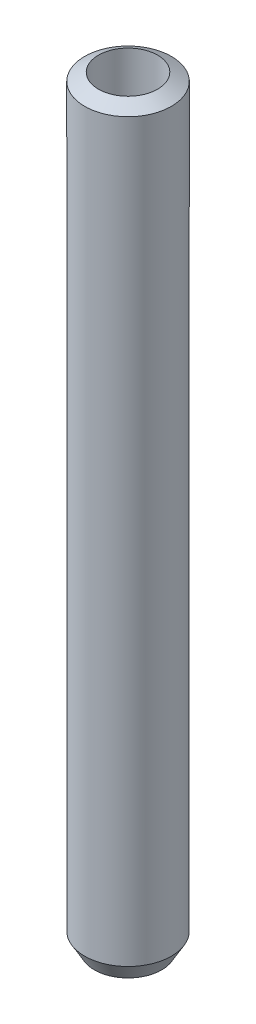
ISO-10303-21;
HEADER;
FILE_DESCRIPTION(('STEP AP214'),'2;1');
FILE_NAME('part.step','',(''),(''),'','','');
FILE_SCHEMA(('AUTOMOTIVE_DESIGN { 1 0 10303 214 1 1 1 1 }'));
ENDSEC;
DATA;
#1=APPLICATION_CONTEXT('core data for automotive mechanical design processes');
#2=APPLICATION_PROTOCOL_DEFINITION('international standard','automotive_design',2000,#1);
#3=PRODUCT_CONTEXT('',#1,'mechanical');
#4=PRODUCT('Part','Part','',(#3));
#5=PRODUCT_RELATED_PRODUCT_CATEGORY('part','',(#4));
#6=PRODUCT_DEFINITION_FORMATION('','',#4);
#7=PRODUCT_DEFINITION_CONTEXT('part definition',#1,'design');
#8=PRODUCT_DEFINITION('design','',#6,#7);
#9=PRODUCT_DEFINITION_SHAPE('','',#8);
#10=(LENGTH_UNIT() NAMED_UNIT(*) SI_UNIT(.MILLI.,.METRE.));
#11=(NAMED_UNIT(*) PLANE_ANGLE_UNIT() SI_UNIT($,.RADIAN.));
#12=(NAMED_UNIT(*) SI_UNIT($,.STERADIAN.) SOLID_ANGLE_UNIT());
#13=UNCERTAINTY_MEASURE_WITH_UNIT(LENGTH_MEASURE(1.E-05),#10,'distance_accuracy_value','');
#14=(GEOMETRIC_REPRESENTATION_CONTEXT(3) GLOBAL_UNCERTAINTY_ASSIGNED_CONTEXT((#13)) GLOBAL_UNIT_ASSIGNED_CONTEXT((#10,
#11,#12)) REPRESENTATION_CONTEXT('',''));
#15=CARTESIAN_POINT('',(0.,0.,0.));
#16=DIRECTION('',(0.,0.,1.));
#17=DIRECTION('',(1.,0.,0.));
#18=AXIS2_PLACEMENT_3D('',#15,#16,#17);
#19=CARTESIAN_POINT('',(0.,395.812140232538,0.));
#20=DIRECTION('',(0.,-1.,0.));
#21=DIRECTION('',(0.,0.,-1.));
#22=AXIS2_PLACEMENT_3D('',#19,#20,#21);
#23=CYLINDRICAL_SURFACE('',#22,22.5);
#24=CARTESIAN_POINT('',(0.,390.783143770465,0.));
#25=DIRECTION('',(0.,1.,0.));
#26=DIRECTION('',(0.,0.,1.));
#27=AXIS2_PLACEMENT_3D('',#24,#25,#26);
#28=CIRCLE('',#27,22.5);
#29=CARTESIAN_POINT('',(0.,390.783143770465,-22.5));
#30=VERTEX_POINT('',#29);
#31=EDGE_CURVE('E50',#30,#30,#28,.F.);
#32=CARTESIAN_POINT('',(0.,8.71047738339487,0.));
#33=DIRECTION('',(0.,1.,0.));
#34=DIRECTION('',(0.,0.,1.));
#35=AXIS2_PLACEMENT_3D('',#32,#33,#34);
#36=CIRCLE('',#35,22.5);
#37=CARTESIAN_POINT('',(0.,8.71047738339481,-22.5));
#38=VERTEX_POINT('',#37);
#39=EDGE_CURVE('E51',#38,#38,#36,.T.);
#40=CARTESIAN_POINT('',(0.,390.783143770465,-22.5));
#41=CARTESIAN_POINT('',(0.,386.803220162266,-22.5));
#42=CARTESIAN_POINT('',(0.,382.823296554067,-22.5));
#43=CARTESIAN_POINT('',(0.,374.86344933767,-22.5));
#44=CARTESIAN_POINT('',(0.,370.883525729471,-22.5));
#45=CARTESIAN_POINT('',(0.,362.923678513074,-22.5));
#46=CARTESIAN_POINT('',(0.,358.943754904875,-22.5));
#47=CARTESIAN_POINT('',(0.,350.983907688478,-22.5));
#48=CARTESIAN_POINT('',(0.,347.00398408028,-22.5));
#49=CARTESIAN_POINT('',(0.,339.044136863882,-22.5));
#50=CARTESIAN_POINT('',(0.,335.064213255684,-22.5));
#51=CARTESIAN_POINT('',(0.,327.104366039286,-22.5));
#52=CARTESIAN_POINT('',(0.,323.124442431088,-22.5));
#53=CARTESIAN_POINT('',(0.,315.16459521469,-22.5));
#54=CARTESIAN_POINT('',(0.,311.184671606492,-22.5));
#55=CARTESIAN_POINT('',(0.,303.224824390094,-22.5));
#56=CARTESIAN_POINT('',(0.,299.244900781896,-22.5));
#57=CARTESIAN_POINT('',(0.,291.285053565499,-22.5));
#58=CARTESIAN_POINT('',(0.,287.3051299573,-22.5));
#59=CARTESIAN_POINT('',(0.,279.345282740903,-22.5));
#60=CARTESIAN_POINT('',(0.,275.365359132704,-22.5));
#61=CARTESIAN_POINT('',(0.,267.405511916307,-22.5));
#62=CARTESIAN_POINT('',(0.,263.425588308108,-22.5));
#63=CARTESIAN_POINT('',(0.,255.465741091711,-22.5));
#64=CARTESIAN_POINT('',(0.,251.485817483512,-22.5));
#65=CARTESIAN_POINT('',(0.,243.525970267115,-22.5));
#66=CARTESIAN_POINT('',(0.,239.546046658916,-22.5));
#67=CARTESIAN_POINT('',(0.,231.586199442519,-22.5));
#68=CARTESIAN_POINT('',(0.,227.60627583432,-22.5));
#69=CARTESIAN_POINT('',(0.,219.646428617923,-22.5));
#70=CARTESIAN_POINT('',(0.,215.666505009724,-22.5));
#71=CARTESIAN_POINT('',(0.,207.706657793327,-22.5));
#72=CARTESIAN_POINT('',(0.,203.726734185128,-22.5));
#73=CARTESIAN_POINT('',(0.,195.766886968731,-22.5));
#74=CARTESIAN_POINT('',(0.,191.786963360532,-22.5));
#75=CARTESIAN_POINT('',(0.,183.827116144135,-22.5));
#76=CARTESIAN_POINT('',(0.,179.847192535937,-22.5));
#77=CARTESIAN_POINT('',(0.,171.887345319539,-22.5));
#78=CARTESIAN_POINT('',(0.,167.907421711341,-22.5));
#79=CARTESIAN_POINT('',(0.,159.947574494943,-22.5));
#80=CARTESIAN_POINT('',(0.,155.967650886745,-22.5));
#81=CARTESIAN_POINT('',(0.,148.007803670347,-22.5));
#82=CARTESIAN_POINT('',(0.,144.027880062149,-22.5));
#83=CARTESIAN_POINT('',(0.,136.068032845751,-22.5));
#84=CARTESIAN_POINT('',(0.,132.088109237553,-22.5));
#85=CARTESIAN_POINT('',(0.,124.128262021155,-22.5));
#86=CARTESIAN_POINT('',(0.,120.148338412957,-22.5));
#87=CARTESIAN_POINT('',(0.,112.18849119656,-22.5));
#88=CARTESIAN_POINT('',(0.,108.208567588361,-22.5));
#89=CARTESIAN_POINT('',(0.,100.248720371964,-22.5));
#90=CARTESIAN_POINT('',(0.,96.268796763765,-22.5));
#91=CARTESIAN_POINT('',(0.,88.3089495473677,-22.5));
#92=CARTESIAN_POINT('',(0.,84.3290259391691,-22.5));
#93=CARTESIAN_POINT('',(0.,76.3691787227718,-22.5));
#94=CARTESIAN_POINT('',(0.,72.3892551145731,-22.5));
#95=CARTESIAN_POINT('',(0.,64.4294078981758,-22.5));
#96=CARTESIAN_POINT('',(0.,60.4494842899772,-22.5));
#97=CARTESIAN_POINT('',(0.,52.4896370735799,-22.5));
#98=CARTESIAN_POINT('',(0.,48.5097134653812,-22.5));
#99=CARTESIAN_POINT('',(0.,40.549866248984,-22.5));
#100=CARTESIAN_POINT('',(0.,36.5699426407853,-22.5));
#101=CARTESIAN_POINT('',(0.,28.610095424388,-22.5));
#102=CARTESIAN_POINT('',(0.,24.6301718161894,-22.5));
#103=CARTESIAN_POINT('',(0.,16.6703245997921,-22.5));
#104=CARTESIAN_POINT('',(0.,12.6904009915934,-22.5));
#105=CARTESIAN_POINT('',(0.,8.71047738339481,-22.5));
#106=B_SPLINE_CURVE_WITH_KNOTS('',3,(#40,#41,#42,#43,#44,#45,#46,#47,#48,#49,#50,#51,#52,#53,
#54,#55,#56,#57,#58,#59,#60,#61,#62,#63,#64,#65,#66,#67,#68,#69,#70,#71,#72,#73,#74,#75,#76,#77,
#78,#79,#80,#81,#82,#83,#84,#85,#86,#87,#88,#89,#90,#91,#92,#93,#94,#95,#96,#97,#98,#99,#100,
#101,#102,#103,#104,#105),.UNSPECIFIED.,.F.,.F.,(4,2,2,2,2,2,2,2,2,2,2,2,2,2,2,2,2,2,2,2,2,2,2,
2,2,2,2,2,2,2,2,2,4),(0.,11.9397708245959,23.8795416491918,35.8193124737878,47.7590832983837,
59.6988541229796,71.6386249475756,83.5783957721715,95.5181665967674,107.457937421363,
119.397708245959,131.337479070555,143.277249895151,155.217020719747,167.156791544343,
179.096562368939,191.036333193535,202.976104018131,214.915874842727,226.855645667323,
238.795416491919,250.735187316514,262.67495814111,274.614728965706,286.554499790302,
298.494270614898,310.434041439494,322.37381226409,334.313583088686,346.253353913282,
358.193124737878,370.132895562474,382.07266638707),.UNSPECIFIED.);
#107=EDGE_CURVE('BSEAM39',#30,#38,#106,.T.);
#108=ORIENTED_EDGE('',*,*,#31,.T.);
#109=ORIENTED_EDGE('',*,*,#39,.T.);
#110=ORIENTED_EDGE('',*,*,#107,.T.);
#111=ORIENTED_EDGE('',*,*,#107,.F.);
#112=EDGE_LOOP('',(#108,#110,#109,#111));
#113=FACE_BOUND('',#112,.T.);
#114=ADVANCED_FACE('F39',(#113),#23,.T.);
#115=CARTESIAN_POINT('',(0.,0.,0.));
#116=DIRECTION('',(0.,1.,0.));
#117=DIRECTION('',(0.,0.,1.));
#118=AXIS2_PLACEMENT_3D('',#115,#116,#117);
#119=PLANE('',#118);
#120=CARTESIAN_POINT('',(0.,0.,0.));
#121=DIRECTION('',(0.,1.,0.));
#122=DIRECTION('',(0.,0.,1.));
#123=AXIS2_PLACEMENT_3D('',#120,#121,#122);
#124=CIRCLE('',#123,17.4710035379268);
#125=CARTESIAN_POINT('',(0.,0.,17.4710035379268));
#126=VERTEX_POINT('',#125);
#127=EDGE_CURVE('E10',#126,#126,#124,.F.);
#128=ORIENTED_EDGE('',*,*,#127,.T.);
#129=EDGE_LOOP('',(#128));
#130=FACE_BOUND('',#129,.T.);
#131=CARTESIAN_POINT('',(0.,0.,0.));
#132=DIRECTION('',(0.,1.,0.));
#133=DIRECTION('',(0.,0.,1.));
#134=AXIS2_PLACEMENT_3D('',#131,#132,#133);
#135=CIRCLE('',#134,15.3464474844127);
#136=CARTESIAN_POINT('',(0.,0.,-15.3464474844127));
#137=VERTEX_POINT('',#136);
#138=EDGE_CURVE('E58',#137,#137,#135,.T.);
#139=ORIENTED_EDGE('',*,*,#138,.T.);
#140=EDGE_LOOP('',(#139));
#141=FACE_BOUND('',#140,.T.);
#142=ADVANCED_FACE('F62',(#130,#141),#119,.F.);
#143=CARTESIAN_POINT('',(0.,395.812140232538,0.));
#144=DIRECTION('',(0.,-1.,0.));
#145=DIRECTION('',(0.,0.,-1.));
#146=AXIS2_PLACEMENT_3D('',#143,#144,#145);
#147=CYLINDRICAL_SURFACE('',#146,15.3464474844127);
#148=CARTESIAN_POINT('',(0.,394.913249241001,0.));
#149=DIRECTION('',(0.,-1.,0.));
#150=DIRECTION('',(0.,0.,-1.));
#151=AXIS2_PLACEMENT_3D('',#148,#149,#150);
#152=CIRCLE('',#151,15.3464474844127);
#153=CARTESIAN_POINT('',(0.,394.913249241001,-15.3464474844127));
#154=VERTEX_POINT('',#153);
#155=EDGE_CURVE('E54',#154,#154,#152,.F.);
#156=CARTESIAN_POINT('',(0.,394.913249241001,-15.3464474844127));
#157=CARTESIAN_POINT('',(0.,390.799569561407,-15.3464474844127));
#158=CARTESIAN_POINT('',(0.,386.685889881814,-15.3464474844127));
#159=CARTESIAN_POINT('',(0.,378.458530522626,-15.3464474844127));
#160=CARTESIAN_POINT('',(0.,374.344850843032,-15.3464474844127));
#161=CARTESIAN_POINT('',(0.,366.117491483845,-15.3464474844127));
#162=CARTESIAN_POINT('',(0.,362.003811804251,-15.3464474844127));
#163=CARTESIAN_POINT('',(0.,353.776452445064,-15.3464474844127));
#164=CARTESIAN_POINT('',(0.,349.66277276547,-15.3464474844127));
#165=CARTESIAN_POINT('',(0.,341.435413406282,-15.3464474844127));
#166=CARTESIAN_POINT('',(0.,337.321733726688,-15.3464474844127));
#167=CARTESIAN_POINT('',(0.,329.094374367501,-15.3464474844127));
#168=CARTESIAN_POINT('',(0.,324.980694687907,-15.3464474844127));
#169=CARTESIAN_POINT('',(0.,316.75333532872,-15.3464474844127));
#170=CARTESIAN_POINT('',(0.,312.639655649126,-15.3464474844127));
#171=CARTESIAN_POINT('',(0.,304.412296289938,-15.3464474844127));
#172=CARTESIAN_POINT('',(0.,300.298616610345,-15.3464474844127));
#173=CARTESIAN_POINT('',(0.,292.071257251157,-15.3464474844127));
#174=CARTESIAN_POINT('',(0.,287.957577571563,-15.3464474844127));
#175=CARTESIAN_POINT('',(0.,279.730218212376,-15.3464474844127));
#176=CARTESIAN_POINT('',(0.,275.616538532782,-15.3464474844127));
#177=CARTESIAN_POINT('',(0.,267.389179173595,-15.3464474844127));
#178=CARTESIAN_POINT('',(0.,263.275499494001,-15.3464474844127));
#179=CARTESIAN_POINT('',(0.,255.048140134813,-15.3464474844127));
#180=CARTESIAN_POINT('',(0.,250.934460455219,-15.3464474844127));
#181=CARTESIAN_POINT('',(0.,242.707101096032,-15.3464474844127));
#182=CARTESIAN_POINT('',(0.,238.593421416438,-15.3464474844127));
#183=CARTESIAN_POINT('',(0.,230.366062057251,-15.3464474844127));
#184=CARTESIAN_POINT('',(0.,226.252382377657,-15.3464474844127));
#185=CARTESIAN_POINT('',(0.,218.025023018469,-15.3464474844127));
#186=CARTESIAN_POINT('',(0.,213.911343338876,-15.3464474844127));
#187=CARTESIAN_POINT('',(0.,205.683983979688,-15.3464474844127));
#188=CARTESIAN_POINT('',(0.,201.570304300094,-15.3464474844127));
#189=CARTESIAN_POINT('',(0.,193.342944940907,-15.3464474844127));
#190=CARTESIAN_POINT('',(0.,189.229265261313,-15.3464474844127));
#191=CARTESIAN_POINT('',(0.,181.001905902126,-15.3464474844127));
#192=CARTESIAN_POINT('',(0.,176.888226222532,-15.3464474844127));
#193=CARTESIAN_POINT('',(0.,168.660866863344,-15.3464474844127));
#194=CARTESIAN_POINT('',(0.,164.54718718375,-15.3464474844127));
#195=CARTESIAN_POINT('',(0.,156.319827824563,-15.3464474844127));
#196=CARTESIAN_POINT('',(0.,152.206148144969,-15.3464474844127));
#197=CARTESIAN_POINT('',(0.,143.978788785782,-15.3464474844127));
#198=CARTESIAN_POINT('',(0.,139.865109106188,-15.3464474844127));
#199=CARTESIAN_POINT('',(0.,131.637749747,-15.3464474844127));
#200=CARTESIAN_POINT('',(0.,127.524070067407,-15.3464474844127));
#201=CARTESIAN_POINT('',(0.,119.296710708219,-15.3464474844127));
#202=CARTESIAN_POINT('',(0.,115.183031028625,-15.3464474844127));
#203=CARTESIAN_POINT('',(0.,106.955671669438,-15.3464474844127));
#204=CARTESIAN_POINT('',(0.,102.841991989844,-15.3464474844127));
#205=CARTESIAN_POINT('',(0.,94.6146326306565,-15.3464474844127));
#206=CARTESIAN_POINT('',(0.,90.5009529510628,-15.3464474844127));
#207=CARTESIAN_POINT('',(0.,82.2735935918753,-15.3464474844127));
#208=CARTESIAN_POINT('',(0.,78.1599139122815,-15.3464474844127));
#209=CARTESIAN_POINT('',(0.,69.932554553094,-15.3464474844127));
#210=CARTESIAN_POINT('',(0.,65.8188748735002,-15.3464474844127));
#211=CARTESIAN_POINT('',(0.,57.5915155143126,-15.3464474844127));
#212=CARTESIAN_POINT('',(0.,53.4778358347189,-15.3464474844127));
#213=CARTESIAN_POINT('',(0.,45.2504764755314,-15.3464474844127));
#214=CARTESIAN_POINT('',(0.,41.1367967959376,-15.3464474844127));
#215=CARTESIAN_POINT('',(0.,32.9094374367501,-15.3464474844127));
#216=CARTESIAN_POINT('',(0.,28.7957577571563,-15.3464474844127));
#217=CARTESIAN_POINT('',(0.,20.5683983979688,-15.3464474844127));
#218=CARTESIAN_POINT('',(0.,16.454718718375,-15.3464474844127));
#219=CARTESIAN_POINT('',(0.,8.2273593591875,-15.3464474844127));
#220=CARTESIAN_POINT('',(0.,4.11367967959375,-15.3464474844127));
#221=CARTESIAN_POINT('',(0.,0.,-15.3464474844127));
#222=B_SPLINE_CURVE_WITH_KNOTS('',3,(#156,#157,#158,#159,#160,#161,#162,#163,#164,#165,#166,
#167,#168,#169,#170,#171,#172,#173,#174,#175,#176,#177,#178,#179,#180,#181,#182,#183,#184,#185,
#186,#187,#188,#189,#190,#191,#192,#193,#194,#195,#196,#197,#198,#199,#200,#201,#202,#203,#204,
#205,#206,#207,#208,#209,#210,#211,#212,#213,#214,#215,#216,#217,#218,#219,#220,#221),
.UNSPECIFIED.,.F.,.F.,(4,2,2,2,2,2,2,2,2,2,2,2,2,2,2,2,2,2,2,2,2,2,2,2,2,2,2,2,2,2,2,2,4),(0.,
12.3410390387813,24.6820780775626,37.0231171163439,49.3641561551252,61.7051951939064,
74.0462342326878,86.3872732714691,98.7283123102503,111.069351349032,123.410390387813,
135.751429426594,148.092468465375,160.433507504157,172.774546542938,185.115585581719,
197.456624620501,209.797663659282,222.138702698063,234.479741736844,246.820780775626,
259.161819814407,271.502858853188,283.84389789197,296.184936930751,308.525975969532,
320.867015008313,333.208054047095,345.549093085876,357.890132124657,370.231171163439,
382.57221020222,394.913249241001),.UNSPECIFIED.);
#223=EDGE_CURVE('BSEAM68',#154,#137,#222,.T.);
#224=ORIENTED_EDGE('',*,*,#155,.T.);
#225=ORIENTED_EDGE('',*,*,#138,.F.);
#226=ORIENTED_EDGE('',*,*,#223,.T.);
#227=ORIENTED_EDGE('',*,*,#223,.F.);
#228=EDGE_LOOP('',(#224,#226,#225,#227));
#229=FACE_BOUND('',#228,.T.);
#230=ADVANCED_FACE('F68',(#229),#147,.F.);
#231=CARTESIAN_POINT('',(0.,395.812140232538,0.));
#232=DIRECTION('',(0.,-1.,0.));
#233=DIRECTION('',(0.,0.,-1.));
#234=AXIS2_PLACEMENT_3D('',#231,#232,#233);
#235=CONICAL_SURFACE('',#234,13.7895226166055,1.0471975511966);
#236=ORIENTED_EDGE('',*,*,#31,.F.);
#237=EDGE_LOOP('',(#236));
#238=FACE_BOUND('',#237,.T.);
#239=ORIENTED_EDGE('',*,*,#155,.F.);
#240=EDGE_LOOP('',(#239));
#241=FACE_BOUND('',#240,.T.);
#242=ADVANCED_FACE('F66',(#238,#241),#235,.T.);
#243=CARTESIAN_POINT('',(0.,8.71047738339487,0.));
#244=DIRECTION('',(0.,1.,0.));
#245=DIRECTION('',(0.,0.,1.));
#246=AXIS2_PLACEMENT_3D('',#243,#244,#245);
#247=CONICAL_SURFACE('',#246,22.5,0.523598775598302);
#248=ORIENTED_EDGE('',*,*,#127,.F.);
#249=EDGE_LOOP('',(#248));
#250=FACE_BOUND('',#249,.T.);
#251=ORIENTED_EDGE('',*,*,#39,.F.);
#252=EDGE_LOOP('',(#251));
#253=FACE_BOUND('',#252,.T.);
#254=ADVANCED_FACE('F45',(#250,#253),#247,.T.);
#255=CLOSED_SHELL('',(#114,#142,#230,#242,#254));
#256=MANIFOLD_SOLID_BREP('B2',#255);
#257=ADVANCED_BREP_SHAPE_REPRESENTATION('',(#18,#256),#14);
#258=SHAPE_DEFINITION_REPRESENTATION(#9,#257);
ENDSEC;
END-ISO-10303-21;
